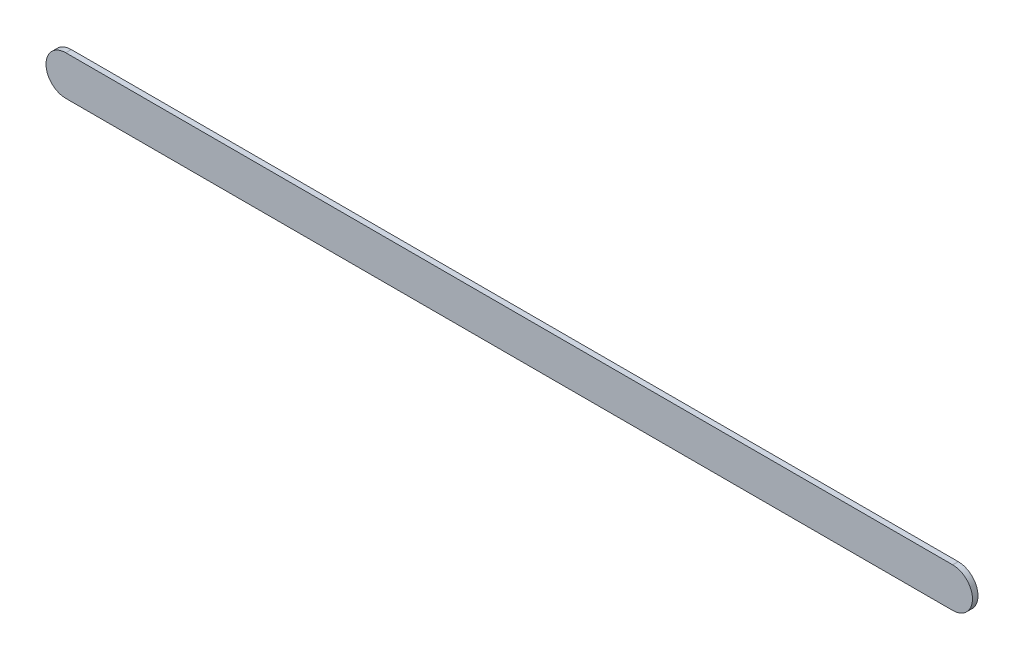
ISO-10303-21;
HEADER;
FILE_DESCRIPTION(('STEP AP214'),'2;1');
FILE_NAME('part.step','',(''),(''),'','','');
FILE_SCHEMA(('AUTOMOTIVE_DESIGN { 1 0 10303 214 1 1 1 1 }'));
ENDSEC;
DATA;
#1=APPLICATION_CONTEXT('core data for automotive mechanical design processes');
#2=APPLICATION_PROTOCOL_DEFINITION('international standard','automotive_design',2000,#1);
#3=PRODUCT_CONTEXT('',#1,'mechanical');
#4=PRODUCT('Part','Part','',(#3));
#5=PRODUCT_RELATED_PRODUCT_CATEGORY('part','',(#4));
#6=PRODUCT_DEFINITION_FORMATION('','',#4);
#7=PRODUCT_DEFINITION_CONTEXT('part definition',#1,'design');
#8=PRODUCT_DEFINITION('design','',#6,#7);
#9=PRODUCT_DEFINITION_SHAPE('','',#8);
#10=(LENGTH_UNIT() NAMED_UNIT(*) SI_UNIT(.MILLI.,.METRE.));
#11=(NAMED_UNIT(*) PLANE_ANGLE_UNIT() SI_UNIT($,.RADIAN.));
#12=(NAMED_UNIT(*) SI_UNIT($,.STERADIAN.) SOLID_ANGLE_UNIT());
#13=UNCERTAINTY_MEASURE_WITH_UNIT(LENGTH_MEASURE(1.E-05),#10,'distance_accuracy_value','');
#14=(GEOMETRIC_REPRESENTATION_CONTEXT(3) GLOBAL_UNCERTAINTY_ASSIGNED_CONTEXT((#13)) GLOBAL_UNIT_ASSIGNED_CONTEXT((#10,
#11,#12)) REPRESENTATION_CONTEXT('',''));
#15=CARTESIAN_POINT('',(0.,0.,0.));
#16=DIRECTION('',(0.,0.,1.));
#17=DIRECTION('',(1.,0.,0.));
#18=AXIS2_PLACEMENT_3D('',#15,#16,#17);
#19=CARTESIAN_POINT('',(92.7169723,97.55997252,0.));
#20=DIRECTION('',(0.,1.,0.));
#21=DIRECTION('',(1.,0.,0.));
#22=AXIS2_PLACEMENT_3D('',#19,#20,#21);
#23=PLANE('',#22);
#24=DIRECTION('',(1.,0.,0.));
#25=VECTOR('',#24,1.);
#26=CARTESIAN_POINT('',(92.7169723,97.55997252,0.03556));
#27=LINE('',#26,#25);
#28=CARTESIAN_POINT('',(92.7169723,97.55997252,0.03556));
#29=VERTEX_POINT('',#28);
#30=CARTESIAN_POINT('',(98.4169736,97.55997252,0.03556));
#31=VERTEX_POINT('',#30);
#32=EDGE_CURVE('E11',#29,#31,#27,.T.);
#33=ORIENTED_EDGE('',*,*,#32,.F.);
#34=DIRECTION('',(0.,0.,1.));
#35=VECTOR('',#34,1.);
#36=CARTESIAN_POINT('',(92.7169723,97.55997252,0.));
#37=LINE('',#36,#35);
#38=CARTESIAN_POINT('',(92.7169723,97.55997252,0.));
#39=VERTEX_POINT('',#38);
#40=EDGE_CURVE('E24',#39,#29,#37,.T.);
#41=ORIENTED_EDGE('',*,*,#40,.F.);
#42=DIRECTION('',(1.,0.,0.));
#43=VECTOR('',#42,1.);
#44=CARTESIAN_POINT('',(92.7169723,97.55997252,0.));
#45=LINE('',#44,#43);
#46=CARTESIAN_POINT('',(98.4169736,97.55997252,0.));
#47=VERTEX_POINT('',#46);
#48=EDGE_CURVE('E75',#39,#47,#45,.T.);
#49=ORIENTED_EDGE('',*,*,#48,.T.);
#50=DIRECTION('',(0.,0.,1.));
#51=VECTOR('',#50,1.);
#52=CARTESIAN_POINT('',(98.4169736,97.55997252,0.));
#53=LINE('',#52,#51);
#54=EDGE_CURVE('E37',#47,#31,#53,.T.);
#55=ORIENTED_EDGE('',*,*,#54,.T.);
#56=EDGE_LOOP('',(#33,#41,#49,#55));
#57=FACE_BOUND('',#56,.T.);
#58=ADVANCED_FACE('F17',(#57),#23,.F.);
#59=CARTESIAN_POINT('',(98.4169736,97.68697252,0.));
#60=DIRECTION('',(0.,0.,-1.));
#61=DIRECTION('',(0.,-1.,0.));
#62=AXIS2_PLACEMENT_3D('',#59,#60,#61);
#63=CYLINDRICAL_SURFACE('',#62,0.126999999999995);
#64=CARTESIAN_POINT('',(98.4169736,97.68697252,0.03556));
#65=DIRECTION('',(0.,0.,1.));
#66=DIRECTION('',(0.,-1.,0.));
#67=AXIS2_PLACEMENT_3D('',#64,#65,#66);
#68=CIRCLE('',#67,0.126999999999995);
#69=CARTESIAN_POINT('',(98.4169736,97.81397252,0.03556));
#70=VERTEX_POINT('',#69);
#71=EDGE_CURVE('E83',#31,#70,#68,.T.);
#72=ORIENTED_EDGE('',*,*,#71,.F.);
#73=ORIENTED_EDGE('',*,*,#54,.F.);
#74=CARTESIAN_POINT('',(98.4169736,97.68697252,0.));
#75=DIRECTION('',(0.,0.,1.));
#76=DIRECTION('',(0.,-1.,0.));
#77=AXIS2_PLACEMENT_3D('',#74,#75,#76);
#78=CIRCLE('',#77,0.126999999999995);
#79=CARTESIAN_POINT('',(98.4169736,97.81397252,0.));
#80=VERTEX_POINT('',#79);
#81=EDGE_CURVE('E81',#47,#80,#78,.T.);
#82=ORIENTED_EDGE('',*,*,#81,.T.);
#83=DIRECTION('',(0.,0.,1.));
#84=VECTOR('',#83,1.);
#85=CARTESIAN_POINT('',(98.4169736,97.81397252,0.));
#86=LINE('',#85,#84);
#87=EDGE_CURVE('E67',#80,#70,#86,.T.);
#88=ORIENTED_EDGE('',*,*,#87,.T.);
#89=EDGE_LOOP('',(#72,#73,#82,#88));
#90=FACE_BOUND('',#89,.T.);
#91=ADVANCED_FACE('F89',(#90),#63,.T.);
#92=CARTESIAN_POINT('',(98.4169736,97.81397252,0.));
#93=DIRECTION('',(0.,-1.,0.));
#94=DIRECTION('',(-1.,0.,0.));
#95=AXIS2_PLACEMENT_3D('',#92,#93,#94);
#96=PLANE('',#95);
#97=DIRECTION('',(-1.,0.,0.));
#98=VECTOR('',#97,1.);
#99=CARTESIAN_POINT('',(98.4169736,97.81397252,0.03556));
#100=LINE('',#99,#98);
#101=CARTESIAN_POINT('',(92.7169723,97.81397252,0.03556));
#102=VERTEX_POINT('',#101);
#103=EDGE_CURVE('E71',#70,#102,#100,.T.);
#104=ORIENTED_EDGE('',*,*,#103,.F.);
#105=ORIENTED_EDGE('',*,*,#87,.F.);
#106=DIRECTION('',(-1.,0.,0.));
#107=VECTOR('',#106,1.);
#108=CARTESIAN_POINT('',(98.4169736,97.81397252,0.));
#109=LINE('',#108,#107);
#110=CARTESIAN_POINT('',(92.7169723,97.81397252,0.));
#111=VERTEX_POINT('',#110);
#112=EDGE_CURVE('E63',#80,#111,#109,.T.);
#113=ORIENTED_EDGE('',*,*,#112,.T.);
#114=DIRECTION('',(0.,0.,1.));
#115=VECTOR('',#114,1.);
#116=CARTESIAN_POINT('',(92.7169723,97.81397252,0.));
#117=LINE('',#116,#115);
#118=EDGE_CURVE('E53',#111,#102,#117,.T.);
#119=ORIENTED_EDGE('',*,*,#118,.T.);
#120=EDGE_LOOP('',(#104,#105,#113,#119));
#121=FACE_BOUND('',#120,.T.);
#122=ADVANCED_FACE('F66',(#121),#96,.F.);
#123=CARTESIAN_POINT('',(92.7169723,97.68697252,0.));
#124=DIRECTION('',(0.,0.,-1.));
#125=DIRECTION('',(0.,1.,0.));
#126=AXIS2_PLACEMENT_3D('',#123,#124,#125);
#127=CYLINDRICAL_SURFACE('',#126,0.126999999999995);
#128=CARTESIAN_POINT('',(92.7169723,97.68697252,0.03556));
#129=DIRECTION('',(0.,0.,1.));
#130=DIRECTION('',(0.,1.,0.));
#131=AXIS2_PLACEMENT_3D('',#128,#129,#130);
#132=CIRCLE('',#131,0.126999999999995);
#133=EDGE_CURVE('E59',#102,#29,#132,.T.);
#134=ORIENTED_EDGE('',*,*,#133,.F.);
#135=ORIENTED_EDGE('',*,*,#118,.F.);
#136=CARTESIAN_POINT('',(92.7169723,97.68697252,0.));
#137=DIRECTION('',(0.,0.,1.));
#138=DIRECTION('',(0.,1.,0.));
#139=AXIS2_PLACEMENT_3D('',#136,#137,#138);
#140=CIRCLE('',#139,0.126999999999995);
#141=EDGE_CURVE('E57',#111,#39,#140,.T.);
#142=ORIENTED_EDGE('',*,*,#141,.T.);
#143=ORIENTED_EDGE('',*,*,#40,.T.);
#144=EDGE_LOOP('',(#134,#135,#142,#143));
#145=FACE_BOUND('',#144,.T.);
#146=ADVANCED_FACE('F55',(#145),#127,.T.);
#147=CARTESIAN_POINT('',(92.7169723,97.55997252,0.));
#148=DIRECTION('',(0.,0.,-1.));
#149=DIRECTION('',(-1.,0.,0.));
#150=AXIS2_PLACEMENT_3D('',#147,#148,#149);
#151=PLANE('',#150);
#152=ORIENTED_EDGE('',*,*,#141,.F.);
#153=ORIENTED_EDGE('',*,*,#112,.F.);
#154=ORIENTED_EDGE('',*,*,#81,.F.);
#155=ORIENTED_EDGE('',*,*,#48,.F.);
#156=EDGE_LOOP('',(#152,#153,#154,#155));
#157=FACE_BOUND('',#156,.T.);
#158=ADVANCED_FACE('F74',(#157),#151,.T.);
#159=CARTESIAN_POINT('',(92.7169723,97.55997252,0.03556));
#160=DIRECTION('',(0.,0.,-1.));
#161=DIRECTION('',(-1.,0.,0.));
#162=AXIS2_PLACEMENT_3D('',#159,#160,#161);
#163=PLANE('',#162);
#164=ORIENTED_EDGE('',*,*,#32,.T.);
#165=ORIENTED_EDGE('',*,*,#71,.T.);
#166=ORIENTED_EDGE('',*,*,#103,.T.);
#167=ORIENTED_EDGE('',*,*,#133,.T.);
#168=EDGE_LOOP('',(#164,#165,#166,#167));
#169=FACE_BOUND('',#168,.T.);
#170=ADVANCED_FACE('F91',(#169),#163,.F.);
#171=CLOSED_SHELL('',(#58,#91,#122,#146,#158,#170));
#172=MANIFOLD_SOLID_BREP('B1',#171);
#173=ADVANCED_BREP_SHAPE_REPRESENTATION('',(#18,#172),#14);
#174=SHAPE_DEFINITION_REPRESENTATION(#9,#173);
ENDSEC;
END-ISO-10303-21;
